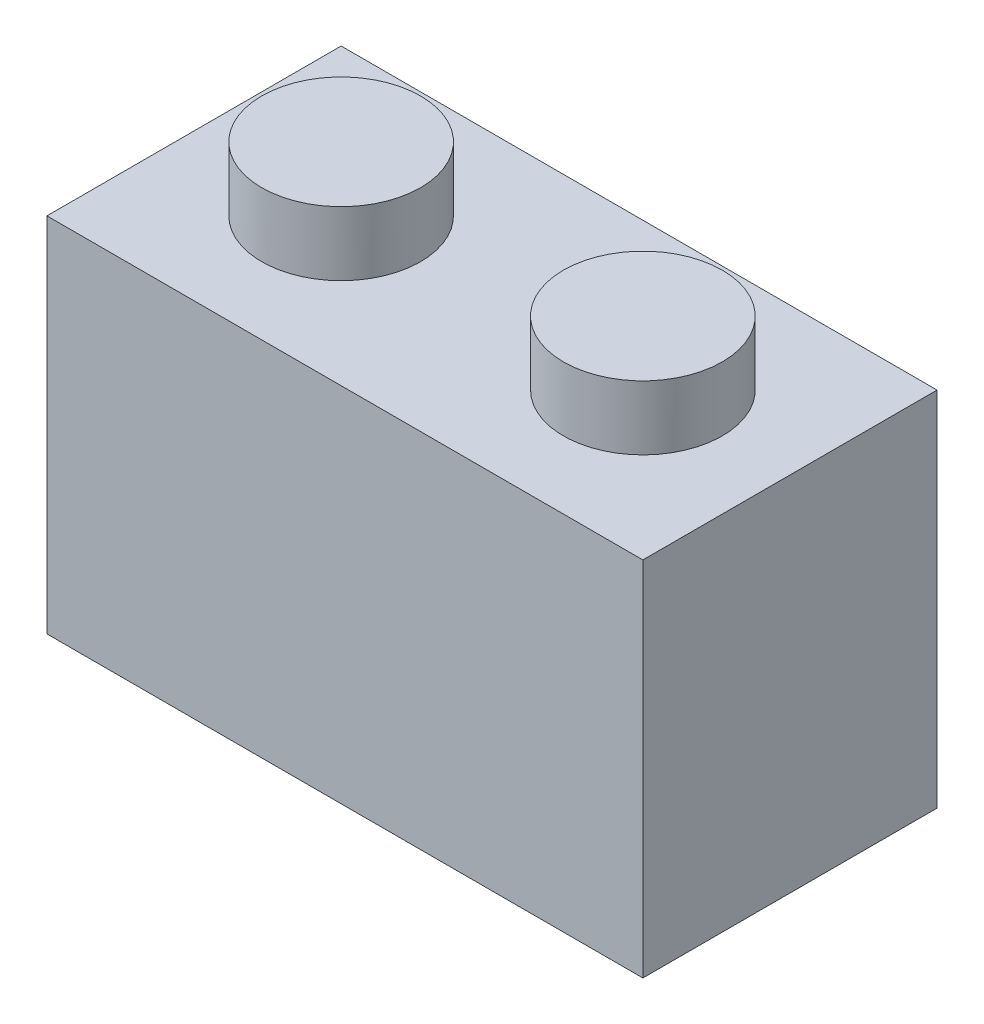
ISO-10303-21;
HEADER;
FILE_DESCRIPTION(('STEP AP214'),'2;1');
FILE_NAME('part.step','',(''),(''),'','','');
FILE_SCHEMA(('AUTOMOTIVE_DESIGN { 1 0 10303 214 1 1 1 1 }'));
ENDSEC;
DATA;
#1=APPLICATION_CONTEXT('core data for automotive mechanical design processes');
#2=APPLICATION_PROTOCOL_DEFINITION('international standard','automotive_design',2000,#1);
#3=PRODUCT_CONTEXT('',#1,'mechanical');
#4=PRODUCT('Part','Part','',(#3));
#5=PRODUCT_RELATED_PRODUCT_CATEGORY('part','',(#4));
#6=PRODUCT_DEFINITION_FORMATION('','',#4);
#7=PRODUCT_DEFINITION_CONTEXT('part definition',#1,'design');
#8=PRODUCT_DEFINITION('design','',#6,#7);
#9=PRODUCT_DEFINITION_SHAPE('','',#8);
#10=(LENGTH_UNIT() NAMED_UNIT(*) SI_UNIT(.MILLI.,.METRE.));
#11=(NAMED_UNIT(*) PLANE_ANGLE_UNIT() SI_UNIT($,.RADIAN.));
#12=(NAMED_UNIT(*) SI_UNIT($,.STERADIAN.) SOLID_ANGLE_UNIT());
#13=UNCERTAINTY_MEASURE_WITH_UNIT(LENGTH_MEASURE(1.E-05),#10,'distance_accuracy_value','');
#14=(GEOMETRIC_REPRESENTATION_CONTEXT(3) GLOBAL_UNCERTAINTY_ASSIGNED_CONTEXT((#13)) GLOBAL_UNIT_ASSIGNED_CONTEXT((#10,
#11,#12)) REPRESENTATION_CONTEXT('',''));
#15=CARTESIAN_POINT('',(0.,0.,0.));
#16=DIRECTION('',(0.,0.,1.));
#17=DIRECTION('',(1.,0.,0.));
#18=AXIS2_PLACEMENT_3D('',#15,#16,#17);
#19=CARTESIAN_POINT('',(0.,9.6,0.));
#20=DIRECTION('',(1.,0.,0.));
#21=DIRECTION('',(0.,0.,-1.));
#22=AXIS2_PLACEMENT_3D('',#19,#20,#21);
#23=PLANE('',#22);
#24=DIRECTION('',(0.,0.,1.));
#25=VECTOR('',#24,1.);
#26=CARTESIAN_POINT('',(0.,0.,0.));
#27=LINE('',#26,#25);
#28=CARTESIAN_POINT('',(0.,0.,-7.8));
#29=VERTEX_POINT('',#28);
#30=CARTESIAN_POINT('',(0.,0.,0.));
#31=VERTEX_POINT('',#30);
#32=EDGE_CURVE('E103',#29,#31,#27,.T.);
#33=ORIENTED_EDGE('',*,*,#32,.T.);
#34=DIRECTION('',(0.,-1.,0.));
#35=VECTOR('',#34,1.);
#36=CARTESIAN_POINT('',(0.,9.6,0.));
#37=LINE('',#36,#35);
#38=CARTESIAN_POINT('',(0.,9.6,0.));
#39=VERTEX_POINT('',#38);
#40=EDGE_CURVE('E94',#39,#31,#37,.T.);
#41=ORIENTED_EDGE('',*,*,#40,.F.);
#42=DIRECTION('',(0.,0.,1.));
#43=VECTOR('',#42,1.);
#44=CARTESIAN_POINT('',(0.,9.6,0.));
#45=LINE('',#44,#43);
#46=CARTESIAN_POINT('',(0.,9.6,-7.8));
#47=VERTEX_POINT('',#46);
#48=EDGE_CURVE('E88',#47,#39,#45,.T.);
#49=ORIENTED_EDGE('',*,*,#48,.F.);
#50=DIRECTION('',(0.,-1.,0.));
#51=VECTOR('',#50,1.);
#52=CARTESIAN_POINT('',(0.,9.6,-7.8));
#53=LINE('',#52,#51);
#54=EDGE_CURVE('E99',#47,#29,#53,.T.);
#55=ORIENTED_EDGE('',*,*,#54,.T.);
#56=EDGE_LOOP('',(#33,#41,#49,#55));
#57=FACE_BOUND('',#56,.T.);
#58=ADVANCED_FACE('F36',(#57),#23,.F.);
#59=CARTESIAN_POINT('',(0.,9.6,0.));
#60=DIRECTION('',(0.,0.,-1.));
#61=DIRECTION('',(-1.,0.,0.));
#62=AXIS2_PLACEMENT_3D('',#59,#60,#61);
#63=PLANE('',#62);
#64=DIRECTION('',(1.,0.,0.));
#65=VECTOR('',#64,1.);
#66=CARTESIAN_POINT('',(0.,0.,0.));
#67=LINE('',#66,#65);
#68=CARTESIAN_POINT('',(15.8,0.,0.));
#69=VERTEX_POINT('',#68);
#70=EDGE_CURVE('E93',#31,#69,#67,.T.);
#71=ORIENTED_EDGE('',*,*,#70,.T.);
#72=DIRECTION('',(0.,-1.,0.));
#73=VECTOR('',#72,1.);
#74=CARTESIAN_POINT('',(15.8,9.6,0.));
#75=LINE('',#74,#73);
#76=CARTESIAN_POINT('',(15.8,9.6,0.));
#77=VERTEX_POINT('',#76);
#78=EDGE_CURVE('E91',#77,#69,#75,.T.);
#79=ORIENTED_EDGE('',*,*,#78,.F.);
#80=DIRECTION('',(1.,0.,0.));
#81=VECTOR('',#80,1.);
#82=CARTESIAN_POINT('',(0.,9.6,0.));
#83=LINE('',#82,#81);
#84=EDGE_CURVE('E83',#39,#77,#83,.T.);
#85=ORIENTED_EDGE('',*,*,#84,.F.);
#86=ORIENTED_EDGE('',*,*,#40,.T.);
#87=EDGE_LOOP('',(#71,#79,#85,#86));
#88=FACE_BOUND('',#87,.T.);
#89=ADVANCED_FACE('F92',(#88),#63,.F.);
#90=CARTESIAN_POINT('',(15.8,9.6,0.));
#91=DIRECTION('',(-1.,0.,0.));
#92=DIRECTION('',(0.,0.,1.));
#93=AXIS2_PLACEMENT_3D('',#90,#91,#92);
#94=PLANE('',#93);
#95=DIRECTION('',(0.,0.,-1.));
#96=VECTOR('',#95,1.);
#97=CARTESIAN_POINT('',(15.8,0.,0.));
#98=LINE('',#97,#96);
#99=CARTESIAN_POINT('',(15.8,0.,-7.8));
#100=VERTEX_POINT('',#99);
#101=EDGE_CURVE('E69',#69,#100,#98,.T.);
#102=ORIENTED_EDGE('',*,*,#101,.T.);
#103=DIRECTION('',(0.,-1.,0.));
#104=VECTOR('',#103,1.);
#105=CARTESIAN_POINT('',(15.8,9.6,-7.8));
#106=LINE('',#105,#104);
#107=CARTESIAN_POINT('',(15.8,9.6,-7.8));
#108=VERTEX_POINT('',#107);
#109=EDGE_CURVE('E95',#108,#100,#106,.T.);
#110=ORIENTED_EDGE('',*,*,#109,.F.);
#111=DIRECTION('',(0.,0.,-1.));
#112=VECTOR('',#111,1.);
#113=CARTESIAN_POINT('',(15.8,9.6,0.));
#114=LINE('',#113,#112);
#115=EDGE_CURVE('E86',#77,#108,#114,.T.);
#116=ORIENTED_EDGE('',*,*,#115,.F.);
#117=ORIENTED_EDGE('',*,*,#78,.T.);
#118=EDGE_LOOP('',(#102,#110,#116,#117));
#119=FACE_BOUND('',#118,.T.);
#120=ADVANCED_FACE('F97',(#119),#94,.F.);
#121=CARTESIAN_POINT('',(0.,9.6,-7.8));
#122=DIRECTION('',(0.,0.,1.));
#123=DIRECTION('',(1.,0.,0.));
#124=AXIS2_PLACEMENT_3D('',#121,#122,#123);
#125=PLANE('',#124);
#126=DIRECTION('',(-1.,0.,0.));
#127=VECTOR('',#126,1.);
#128=CARTESIAN_POINT('',(0.,0.,-7.8));
#129=LINE('',#128,#127);
#130=EDGE_CURVE('E75',#100,#29,#129,.T.);
#131=ORIENTED_EDGE('',*,*,#130,.T.);
#132=ORIENTED_EDGE('',*,*,#54,.F.);
#133=DIRECTION('',(-1.,0.,0.));
#134=VECTOR('',#133,1.);
#135=CARTESIAN_POINT('',(0.,9.6,-7.8));
#136=LINE('',#135,#134);
#137=EDGE_CURVE('E52',#108,#47,#136,.T.);
#138=ORIENTED_EDGE('',*,*,#137,.F.);
#139=ORIENTED_EDGE('',*,*,#109,.T.);
#140=EDGE_LOOP('',(#131,#132,#138,#139));
#141=FACE_BOUND('',#140,.T.);
#142=ADVANCED_FACE('F119',(#141),#125,.F.);
#143=CARTESIAN_POINT('',(0.,9.6,0.));
#144=DIRECTION('',(0.,-1.,0.));
#145=DIRECTION('',(0.,0.,-1.));
#146=AXIS2_PLACEMENT_3D('',#143,#144,#145);
#147=PLANE('',#146);
#148=CARTESIAN_POINT('',(11.9,9.6,-3.9));
#149=DIRECTION('',(0.,-1.,0.));
#150=DIRECTION('',(0.,0.,-1.));
#151=AXIS2_PLACEMENT_3D('',#148,#149,#150);
#152=CIRCLE('',#151,2.10666051334985);
#153=CARTESIAN_POINT('',(11.9,9.6,-6.00666051334985));
#154=VERTEX_POINT('',#153);
#155=EDGE_CURVE('E11',#154,#154,#152,.F.);
#156=ORIENTED_EDGE('',*,*,#155,.F.);
#157=EDGE_LOOP('',(#156));
#158=FACE_BOUND('',#157,.T.);
#159=CARTESIAN_POINT('',(3.9,9.6,-3.9));
#160=DIRECTION('',(0.,-1.,0.));
#161=DIRECTION('',(0.,0.,-1.));
#162=AXIS2_PLACEMENT_3D('',#159,#160,#161);
#163=CIRCLE('',#162,2.10666051334986);
#164=CARTESIAN_POINT('',(3.9,9.6,-6.00666051334986));
#165=VERTEX_POINT('',#164);
#166=EDGE_CURVE('E44',#165,#165,#163,.F.);
#167=ORIENTED_EDGE('',*,*,#166,.F.);
#168=EDGE_LOOP('',(#167));
#169=FACE_BOUND('',#168,.T.);
#170=ORIENTED_EDGE('',*,*,#48,.T.);
#171=ORIENTED_EDGE('',*,*,#84,.T.);
#172=ORIENTED_EDGE('',*,*,#115,.T.);
#173=ORIENTED_EDGE('',*,*,#137,.T.);
#174=EDGE_LOOP('',(#170,#171,#172,#173));
#175=FACE_BOUND('',#174,.T.);
#176=ADVANCED_FACE('F84',(#158,#169,#175),#147,.F.);
#177=CARTESIAN_POINT('',(0.,0.,0.));
#178=DIRECTION('',(0.,-1.,0.));
#179=DIRECTION('',(0.,0.,-1.));
#180=AXIS2_PLACEMENT_3D('',#177,#178,#179);
#181=PLANE('',#180);
#182=CARTESIAN_POINT('',(11.9,0.,-3.9));
#183=DIRECTION('',(0.,-1.,0.));
#184=DIRECTION('',(0.,0.,-1.));
#185=AXIS2_PLACEMENT_3D('',#182,#183,#184);
#186=CIRCLE('',#185,2.5);
#187=CARTESIAN_POINT('',(11.9,0.,-6.4));
#188=VERTEX_POINT('',#187);
#189=EDGE_CURVE('E151',#188,#188,#186,.T.);
#190=ORIENTED_EDGE('',*,*,#189,.F.);
#191=EDGE_LOOP('',(#190));
#192=FACE_BOUND('',#191,.T.);
#193=CARTESIAN_POINT('',(3.9,0.,-3.90000000000006));
#194=DIRECTION('',(0.,-1.,0.));
#195=DIRECTION('',(0.,0.,-1.));
#196=AXIS2_PLACEMENT_3D('',#193,#194,#195);
#197=CIRCLE('',#196,2.5);
#198=CARTESIAN_POINT('',(3.9,0.,-6.40000000000006));
#199=VERTEX_POINT('',#198);
#200=EDGE_CURVE('E145',#199,#199,#197,.T.);
#201=ORIENTED_EDGE('',*,*,#200,.F.);
#202=EDGE_LOOP('',(#201));
#203=FACE_BOUND('',#202,.T.);
#204=ORIENTED_EDGE('',*,*,#32,.F.);
#205=ORIENTED_EDGE('',*,*,#130,.F.);
#206=ORIENTED_EDGE('',*,*,#101,.F.);
#207=ORIENTED_EDGE('',*,*,#70,.F.);
#208=EDGE_LOOP('',(#204,#205,#206,#207));
#209=FACE_BOUND('',#208,.T.);
#210=ADVANCED_FACE('F118',(#192,#203,#209),#181,.T.);
#211=CARTESIAN_POINT('',(3.9,11.3,-3.9));
#212=DIRECTION('',(0.,-1.,0.));
#213=DIRECTION('',(0.,0.,-1.));
#214=AXIS2_PLACEMENT_3D('',#211,#212,#213);
#215=CYLINDRICAL_SURFACE('',#214,2.10666051334986);
#216=CARTESIAN_POINT('',(3.9,11.3,-3.9));
#217=DIRECTION('',(0.,1.,0.));
#218=DIRECTION('',(0.,0.,1.));
#219=AXIS2_PLACEMENT_3D('',#216,#217,#218);
#220=CIRCLE('',#219,2.10666051334986);
#221=CARTESIAN_POINT('',(3.9,11.3,-1.79333948665014));
#222=VERTEX_POINT('',#221);
#223=EDGE_CURVE('E106',#222,#222,#220,.T.);
#224=ORIENTED_EDGE('',*,*,#223,.F.);
#225=EDGE_LOOP('',(#224));
#226=FACE_BOUND('',#225,.T.);
#227=ORIENTED_EDGE('',*,*,#166,.T.);
#228=EDGE_LOOP('',(#227));
#229=FACE_BOUND('',#228,.T.);
#230=ADVANCED_FACE('F115',(#226,#229),#215,.T.);
#231=CARTESIAN_POINT('',(3.9,11.3,-3.9));
#232=DIRECTION('',(0.,1.,0.));
#233=DIRECTION('',(0.,0.,1.));
#234=AXIS2_PLACEMENT_3D('',#231,#232,#233);
#235=PLANE('',#234);
#236=ORIENTED_EDGE('',*,*,#223,.T.);
#237=EDGE_LOOP('',(#236));
#238=FACE_BOUND('',#237,.T.);
#239=ADVANCED_FACE('F186',(#238),#235,.T.);
#240=CARTESIAN_POINT('',(11.9,11.3,-3.9));
#241=DIRECTION('',(0.,-1.,0.));
#242=DIRECTION('',(0.,0.,-1.));
#243=AXIS2_PLACEMENT_3D('',#240,#241,#242);
#244=CYLINDRICAL_SURFACE('',#243,2.10666051334985);
#245=CARTESIAN_POINT('',(11.9,11.3,-3.9));
#246=DIRECTION('',(0.,1.,0.));
#247=DIRECTION('',(0.,0.,1.));
#248=AXIS2_PLACEMENT_3D('',#245,#246,#247);
#249=CIRCLE('',#248,2.10666051334985);
#250=CARTESIAN_POINT('',(11.9,11.3,-1.79333948665015));
#251=VERTEX_POINT('',#250);
#252=EDGE_CURVE('E141',#251,#251,#249,.T.);
#253=ORIENTED_EDGE('',*,*,#252,.F.);
#254=EDGE_LOOP('',(#253));
#255=FACE_BOUND('',#254,.T.);
#256=ORIENTED_EDGE('',*,*,#155,.T.);
#257=EDGE_LOOP('',(#256));
#258=FACE_BOUND('',#257,.T.);
#259=ADVANCED_FACE('F179',(#255,#258),#244,.T.);
#260=CARTESIAN_POINT('',(11.9,11.3,-3.9));
#261=DIRECTION('',(0.,1.,0.));
#262=DIRECTION('',(0.,0.,1.));
#263=AXIS2_PLACEMENT_3D('',#260,#261,#262);
#264=PLANE('',#263);
#265=ORIENTED_EDGE('',*,*,#252,.T.);
#266=EDGE_LOOP('',(#265));
#267=FACE_BOUND('',#266,.T.);
#268=ADVANCED_FACE('F170',(#267),#264,.T.);
#269=CARTESIAN_POINT('',(3.9,1.8,-3.90000000000006));
#270=DIRECTION('',(0.,-1.,0.));
#271=DIRECTION('',(0.,0.,-1.));
#272=AXIS2_PLACEMENT_3D('',#269,#270,#271);
#273=CYLINDRICAL_SURFACE('',#272,2.5);
#274=CARTESIAN_POINT('',(3.9,1.8,-3.90000000000006));
#275=DIRECTION('',(0.,-1.,0.));
#276=DIRECTION('',(0.,0.,-1.));
#277=AXIS2_PLACEMENT_3D('',#274,#275,#276);
#278=CIRCLE('',#277,2.5);
#279=CARTESIAN_POINT('',(3.9,1.8,-6.40000000000006));
#280=VERTEX_POINT('',#279);
#281=EDGE_CURVE('E148',#280,#280,#278,.T.);
#282=ORIENTED_EDGE('',*,*,#281,.F.);
#283=EDGE_LOOP('',(#282));
#284=FACE_BOUND('',#283,.T.);
#285=ORIENTED_EDGE('',*,*,#200,.T.);
#286=EDGE_LOOP('',(#285));
#287=FACE_BOUND('',#286,.T.);
#288=ADVANCED_FACE('F168',(#284,#287),#273,.F.);
#289=CARTESIAN_POINT('',(3.9,1.8,-3.90000000000006));
#290=DIRECTION('',(0.,-1.,0.));
#291=DIRECTION('',(0.,0.,-1.));
#292=AXIS2_PLACEMENT_3D('',#289,#290,#291);
#293=PLANE('',#292);
#294=ORIENTED_EDGE('',*,*,#281,.T.);
#295=EDGE_LOOP('',(#294));
#296=FACE_BOUND('',#295,.T.);
#297=ADVANCED_FACE('F162',(#296),#293,.T.);
#298=CARTESIAN_POINT('',(11.9,1.8,-3.9));
#299=DIRECTION('',(0.,-1.,0.));
#300=DIRECTION('',(0.,0.,-1.));
#301=AXIS2_PLACEMENT_3D('',#298,#299,#300);
#302=CYLINDRICAL_SURFACE('',#301,2.5);
#303=CARTESIAN_POINT('',(11.9,1.8,-3.9));
#304=DIRECTION('',(0.,-1.,0.));
#305=DIRECTION('',(0.,0.,-1.));
#306=AXIS2_PLACEMENT_3D('',#303,#304,#305);
#307=CIRCLE('',#306,2.5);
#308=CARTESIAN_POINT('',(11.9,1.8,-6.4));
#309=VERTEX_POINT('',#308);
#310=EDGE_CURVE('E144',#309,#309,#307,.T.);
#311=ORIENTED_EDGE('',*,*,#310,.F.);
#312=EDGE_LOOP('',(#311));
#313=FACE_BOUND('',#312,.T.);
#314=ORIENTED_EDGE('',*,*,#189,.T.);
#315=EDGE_LOOP('',(#314));
#316=FACE_BOUND('',#315,.T.);
#317=ADVANCED_FACE('F159',(#313,#316),#302,.F.);
#318=CARTESIAN_POINT('',(11.9,1.8,-3.9));
#319=DIRECTION('',(0.,-1.,0.));
#320=DIRECTION('',(0.,0.,-1.));
#321=AXIS2_PLACEMENT_3D('',#318,#319,#320);
#322=PLANE('',#321);
#323=ORIENTED_EDGE('',*,*,#310,.T.);
#324=EDGE_LOOP('',(#323));
#325=FACE_BOUND('',#324,.T.);
#326=ADVANCED_FACE('F157',(#325),#322,.T.);
#327=CLOSED_SHELL('',(#58,#89,#120,#142,#176,#210,#230,#239,#259,#268,#288,#297,#317,#326));
#328=MANIFOLD_SOLID_BREP('B2',#327);
#329=ADVANCED_BREP_SHAPE_REPRESENTATION('',(#18,#328),#14);
#330=SHAPE_DEFINITION_REPRESENTATION(#9,#329);
ENDSEC;
END-ISO-10303-21;
